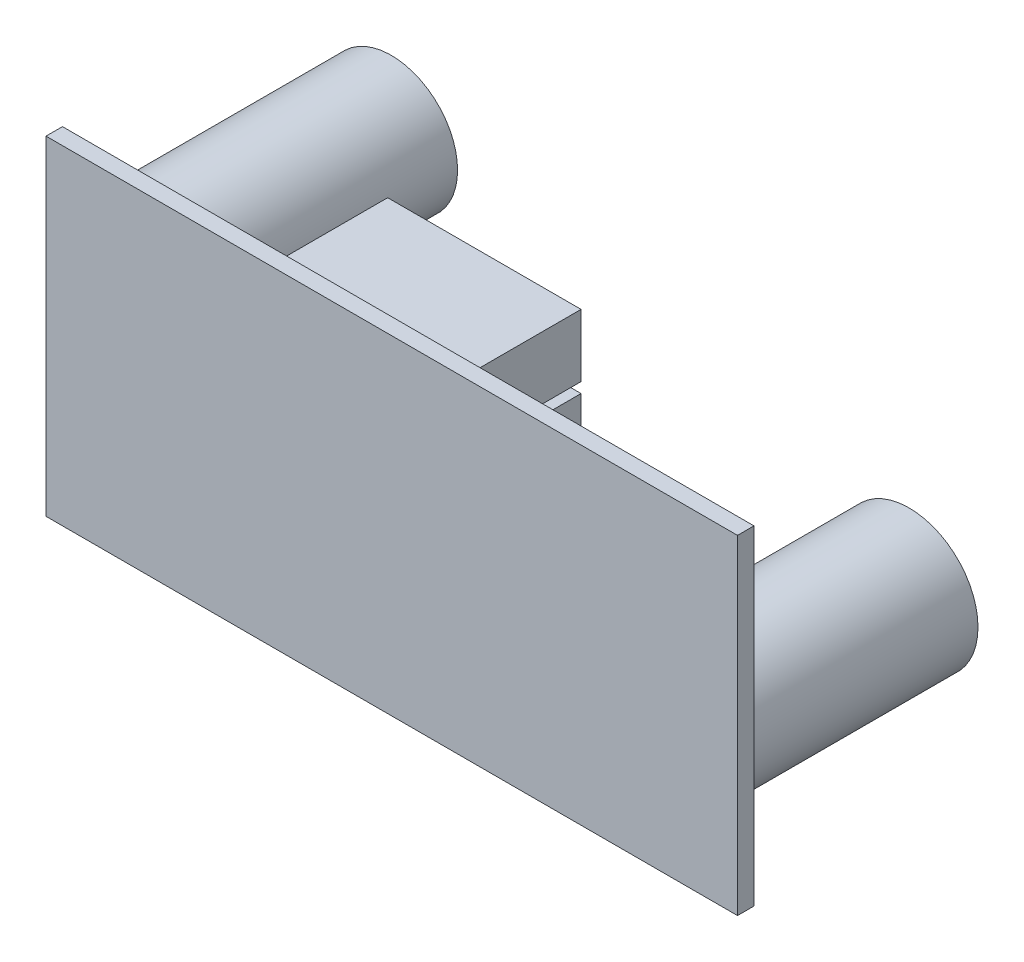
ISO-10303-21;
HEADER;
FILE_DESCRIPTION(('STEP AP214'),'2;1');
FILE_NAME('part.step','',(''),(''),'','','');
FILE_SCHEMA(('AUTOMOTIVE_DESIGN { 1 0 10303 214 1 1 1 1 }'));
ENDSEC;
DATA;
#1=APPLICATION_CONTEXT('core data for automotive mechanical design processes');
#2=APPLICATION_PROTOCOL_DEFINITION('international standard','automotive_design',2000,#1);
#3=PRODUCT_CONTEXT('',#1,'mechanical');
#4=PRODUCT('Part','Part','',(#3));
#5=PRODUCT_RELATED_PRODUCT_CATEGORY('part','',(#4));
#6=PRODUCT_DEFINITION_FORMATION('','',#4);
#7=PRODUCT_DEFINITION_CONTEXT('part definition',#1,'design');
#8=PRODUCT_DEFINITION('design','',#6,#7);
#9=PRODUCT_DEFINITION_SHAPE('','',#8);
#10=(LENGTH_UNIT() NAMED_UNIT(*) SI_UNIT(.MILLI.,.METRE.));
#11=(NAMED_UNIT(*) PLANE_ANGLE_UNIT() SI_UNIT($,.RADIAN.));
#12=(NAMED_UNIT(*) SI_UNIT($,.STERADIAN.) SOLID_ANGLE_UNIT());
#13=UNCERTAINTY_MEASURE_WITH_UNIT(LENGTH_MEASURE(1.E-05),#10,'distance_accuracy_value','');
#14=(GEOMETRIC_REPRESENTATION_CONTEXT(3) GLOBAL_UNCERTAINTY_ASSIGNED_CONTEXT((#13)) GLOBAL_UNIT_ASSIGNED_CONTEXT((#10,
#11,#12)) REPRESENTATION_CONTEXT('',''));
#15=CARTESIAN_POINT('',(0.,0.,0.));
#16=DIRECTION('',(0.,0.,1.));
#17=DIRECTION('',(1.,0.,0.));
#18=AXIS2_PLACEMENT_3D('',#15,#16,#17);
#19=CARTESIAN_POINT('',(-25.9311740890688,5.2914979757085,1.));
#20=DIRECTION('',(1.,0.,0.));
#21=DIRECTION('',(0.,1.,0.));
#22=AXIS2_PLACEMENT_3D('',#19,#20,#21);
#23=PLANE('',#22);
#24=DIRECTION('',(0.,-1.,0.));
#25=VECTOR('',#24,1.);
#26=CARTESIAN_POINT('',(-25.9311740890688,5.2914979757085,0.));
#27=LINE('',#26,#25);
#28=CARTESIAN_POINT('',(-25.9311740890688,5.2914979757085,0.));
#29=VERTEX_POINT('',#28);
#30=CARTESIAN_POINT('',(-25.9311740890688,-14.7085020242915,0.));
#31=VERTEX_POINT('',#30);
#32=EDGE_CURVE('E202',#29,#31,#27,.T.);
#33=ORIENTED_EDGE('',*,*,#32,.T.);
#34=DIRECTION('',(0.,0.,-1.));
#35=VECTOR('',#34,1.);
#36=CARTESIAN_POINT('',(-25.9311740890688,-14.7085020242915,1.));
#37=LINE('',#36,#35);
#38=CARTESIAN_POINT('',(-25.9311740890688,-14.7085020242915,1.));
#39=VERTEX_POINT('',#38);
#40=EDGE_CURVE('E11',#39,#31,#37,.T.);
#41=ORIENTED_EDGE('',*,*,#40,.F.);
#42=DIRECTION('',(0.,-1.,0.));
#43=VECTOR('',#42,1.);
#44=CARTESIAN_POINT('',(-25.9311740890688,5.2914979757085,1.));
#45=LINE('',#44,#43);
#46=CARTESIAN_POINT('',(-25.9311740890688,5.2914979757085,1.));
#47=VERTEX_POINT('',#46);
#48=EDGE_CURVE('E205',#47,#39,#45,.T.);
#49=ORIENTED_EDGE('',*,*,#48,.F.);
#50=DIRECTION('',(0.,0.,-1.));
#51=VECTOR('',#50,1.);
#52=CARTESIAN_POINT('',(-25.9311740890688,5.2914979757085,1.));
#53=LINE('',#52,#51);
#54=EDGE_CURVE('E215',#47,#29,#53,.T.);
#55=ORIENTED_EDGE('',*,*,#54,.T.);
#56=EDGE_LOOP('',(#33,#41,#49,#55));
#57=FACE_BOUND('',#56,.T.);
#58=ADVANCED_FACE('F34',(#57),#23,.F.);
#59=CARTESIAN_POINT('',(-25.9311740890688,-14.7085020242915,1.));
#60=DIRECTION('',(0.,1.,0.));
#61=DIRECTION('',(0.,0.,1.));
#62=AXIS2_PLACEMENT_3D('',#59,#60,#61);
#63=PLANE('',#62);
#64=DIRECTION('',(1.,0.,0.));
#65=VECTOR('',#64,1.);
#66=CARTESIAN_POINT('',(-25.9311740890688,-14.7085020242915,0.));
#67=LINE('',#66,#65);
#68=CARTESIAN_POINT('',(16.0688259109312,-14.7085020242915,0.));
#69=VERTEX_POINT('',#68);
#70=EDGE_CURVE('E218',#31,#69,#67,.T.);
#71=ORIENTED_EDGE('',*,*,#70,.T.);
#72=DIRECTION('',(0.,0.,-1.));
#73=VECTOR('',#72,1.);
#74=CARTESIAN_POINT('',(16.0688259109312,-14.7085020242915,1.));
#75=LINE('',#74,#73);
#76=CARTESIAN_POINT('',(16.0688259109312,-14.7085020242915,1.));
#77=VERTEX_POINT('',#76);
#78=EDGE_CURVE('E41',#77,#69,#75,.T.);
#79=ORIENTED_EDGE('',*,*,#78,.F.);
#80=DIRECTION('',(1.,0.,0.));
#81=VECTOR('',#80,1.);
#82=CARTESIAN_POINT('',(-25.9311740890688,-14.7085020242915,1.));
#83=LINE('',#82,#81);
#84=EDGE_CURVE('E208',#39,#77,#83,.T.);
#85=ORIENTED_EDGE('',*,*,#84,.F.);
#86=ORIENTED_EDGE('',*,*,#40,.T.);
#87=EDGE_LOOP('',(#71,#79,#85,#86));
#88=FACE_BOUND('',#87,.T.);
#89=ADVANCED_FACE('F248',(#88),#63,.F.);
#90=CARTESIAN_POINT('',(16.0688259109312,5.2914979757085,1.));
#91=DIRECTION('',(-1.,0.,0.));
#92=DIRECTION('',(0.,0.,1.));
#93=AXIS2_PLACEMENT_3D('',#90,#91,#92);
#94=PLANE('',#93);
#95=DIRECTION('',(0.,1.,0.));
#96=VECTOR('',#95,1.);
#97=CARTESIAN_POINT('',(16.0688259109312,5.2914979757085,0.));
#98=LINE('',#97,#96);
#99=CARTESIAN_POINT('',(16.0688259109312,5.2914979757085,0.));
#100=VERTEX_POINT('',#99);
#101=EDGE_CURVE('E220',#69,#100,#98,.T.);
#102=ORIENTED_EDGE('',*,*,#101,.T.);
#103=DIRECTION('',(0.,0.,-1.));
#104=VECTOR('',#103,1.);
#105=CARTESIAN_POINT('',(16.0688259109312,5.2914979757085,1.));
#106=LINE('',#105,#104);
#107=CARTESIAN_POINT('',(16.0688259109312,5.2914979757085,1.));
#108=VERTEX_POINT('',#107);
#109=EDGE_CURVE('E225',#108,#100,#106,.T.);
#110=ORIENTED_EDGE('',*,*,#109,.F.);
#111=DIRECTION('',(0.,1.,0.));
#112=VECTOR('',#111,1.);
#113=CARTESIAN_POINT('',(16.0688259109312,5.2914979757085,1.));
#114=LINE('',#113,#112);
#115=EDGE_CURVE('E211',#77,#108,#114,.T.);
#116=ORIENTED_EDGE('',*,*,#115,.F.);
#117=ORIENTED_EDGE('',*,*,#78,.T.);
#118=EDGE_LOOP('',(#102,#110,#116,#117));
#119=FACE_BOUND('',#118,.T.);
#120=ADVANCED_FACE('F232',(#119),#94,.F.);
#121=CARTESIAN_POINT('',(-25.9311740890688,5.2914979757085,1.));
#122=DIRECTION('',(0.,-1.,0.));
#123=DIRECTION('',(0.,0.,-1.));
#124=AXIS2_PLACEMENT_3D('',#121,#122,#123);
#125=PLANE('',#124);
#126=DIRECTION('',(-1.,0.,0.));
#127=VECTOR('',#126,1.);
#128=CARTESIAN_POINT('',(-25.9311740890688,5.2914979757085,0.));
#129=LINE('',#128,#127);
#130=EDGE_CURVE('E209',#100,#29,#129,.T.);
#131=ORIENTED_EDGE('',*,*,#130,.T.);
#132=ORIENTED_EDGE('',*,*,#54,.F.);
#133=DIRECTION('',(-1.,0.,0.));
#134=VECTOR('',#133,1.);
#135=CARTESIAN_POINT('',(-25.9311740890688,5.2914979757085,1.));
#136=LINE('',#135,#134);
#137=EDGE_CURVE('E213',#108,#47,#136,.T.);
#138=ORIENTED_EDGE('',*,*,#137,.F.);
#139=ORIENTED_EDGE('',*,*,#109,.T.);
#140=EDGE_LOOP('',(#131,#132,#138,#139));
#141=FACE_BOUND('',#140,.T.);
#142=ADVANCED_FACE('F241',(#141),#125,.F.);
#143=CARTESIAN_POINT('',(0.,0.,1.));
#144=DIRECTION('',(0.,0.,1.));
#145=DIRECTION('',(1.,0.,0.));
#146=AXIS2_PLACEMENT_3D('',#143,#144,#145);
#147=PLANE('',#146);
#148=ORIENTED_EDGE('',*,*,#48,.T.);
#149=ORIENTED_EDGE('',*,*,#84,.T.);
#150=ORIENTED_EDGE('',*,*,#115,.T.);
#151=ORIENTED_EDGE('',*,*,#137,.T.);
#152=EDGE_LOOP('',(#148,#149,#150,#151));
#153=FACE_BOUND('',#152,.T.);
#154=ADVANCED_FACE('F247',(#153),#147,.T.);
#155=CARTESIAN_POINT('',(0.,0.,0.));
#156=DIRECTION('',(0.,0.,1.));
#157=DIRECTION('',(1.,0.,0.));
#158=AXIS2_PLACEMENT_3D('',#155,#156,#157);
#159=PLANE('',#158);
#160=DIRECTION('',(-1.,0.,0.));
#161=VECTOR('',#160,1.);
#162=CARTESIAN_POINT('',(-13.1781841422702,0.,0.));
#163=LINE('',#162,#161);
#164=CARTESIAN_POINT('',(-1.43471503719272,0.,0.));
#165=VERTEX_POINT('',#164);
#166=CARTESIAN_POINT('',(-13.1781841422702,0.,0.));
#167=VERTEX_POINT('',#166);
#168=EDGE_CURVE('E147',#165,#167,#163,.T.);
#169=ORIENTED_EDGE('',*,*,#168,.T.);
#170=DIRECTION('',(0.,-1.,0.));
#171=VECTOR('',#170,1.);
#172=CARTESIAN_POINT('',(-13.1781841422702,0.,0.));
#173=LINE('',#172,#171);
#174=CARTESIAN_POINT('',(-13.1781841422702,-12.9835587703897,0.));
#175=VERTEX_POINT('',#174);
#176=EDGE_CURVE('E154',#167,#175,#173,.T.);
#177=ORIENTED_EDGE('',*,*,#176,.T.);
#178=DIRECTION('',(1.,0.,0.));
#179=VECTOR('',#178,1.);
#180=CARTESIAN_POINT('',(-13.1781841422702,-12.9835587703897,0.));
#181=LINE('',#180,#179);
#182=CARTESIAN_POINT('',(-1.43471503719272,-12.9835587703897,0.));
#183=VERTEX_POINT('',#182);
#184=EDGE_CURVE('E127',#175,#183,#181,.T.);
#185=ORIENTED_EDGE('',*,*,#184,.T.);
#186=DIRECTION('',(0.,1.,0.));
#187=VECTOR('',#186,1.);
#188=CARTESIAN_POINT('',(-1.43471503719272,0.,0.));
#189=LINE('',#188,#187);
#190=EDGE_CURVE('E48',#183,#165,#189,.T.);
#191=ORIENTED_EDGE('',*,*,#190,.T.);
#192=EDGE_LOOP('',(#169,#177,#185,#191));
#193=FACE_BOUND('',#192,.T.);
#194=DIRECTION('',(-1.,0.,0.));
#195=VECTOR('',#194,1.);
#196=CARTESIAN_POINT('',(-13.1781841422702,4.42810080411027,0.));
#197=LINE('',#196,#195);
#198=CARTESIAN_POINT('',(-1.43309074962872,4.42810080411027,0.));
#199=VERTEX_POINT('',#198);
#200=CARTESIAN_POINT('',(-13.1781841422702,4.42810080411027,0.));
#201=VERTEX_POINT('',#200);
#202=EDGE_CURVE('E167',#199,#201,#197,.T.);
#203=ORIENTED_EDGE('',*,*,#202,.T.);
#204=DIRECTION('',(0.,-1.,0.));
#205=VECTOR('',#204,1.);
#206=CARTESIAN_POINT('',(-13.1781841422702,4.42810080411027,0.));
#207=LINE('',#206,#205);
#208=CARTESIAN_POINT('',(-13.1781841422702,0.627354008456926,0.));
#209=VERTEX_POINT('',#208);
#210=EDGE_CURVE('E159',#201,#209,#207,.T.);
#211=ORIENTED_EDGE('',*,*,#210,.T.);
#212=DIRECTION('',(1.,0.,0.));
#213=VECTOR('',#212,1.);
#214=CARTESIAN_POINT('',(-13.1781841422702,0.627354008456926,0.));
#215=LINE('',#214,#213);
#216=CARTESIAN_POINT('',(-1.43309074962872,0.627354008456926,0.));
#217=VERTEX_POINT('',#216);
#218=EDGE_CURVE('E179',#209,#217,#215,.T.);
#219=ORIENTED_EDGE('',*,*,#218,.T.);
#220=DIRECTION('',(0.,1.,0.));
#221=VECTOR('',#220,1.);
#222=CARTESIAN_POINT('',(-1.43309074962872,4.42810080411027,0.));
#223=LINE('',#222,#221);
#224=EDGE_CURVE('E56',#217,#199,#223,.T.);
#225=ORIENTED_EDGE('',*,*,#224,.T.);
#226=EDGE_LOOP('',(#203,#211,#219,#225));
#227=FACE_BOUND('',#226,.T.);
#228=CARTESIAN_POINT('',(10.4930760803745,-8.23466300271962,0.));
#229=DIRECTION('',(0.,0.,1.));
#230=DIRECTION('',(1.,0.,0.));
#231=AXIS2_PLACEMENT_3D('',#228,#229,#230);
#232=CIRCLE('',#231,4.18270672569634);
#233=CARTESIAN_POINT('',(14.6757828060708,-8.23466300271962,0.));
#234=VERTEX_POINT('',#233);
#235=EDGE_CURVE('E187',#234,#234,#232,.T.);
#236=ORIENTED_EDGE('',*,*,#235,.T.);
#237=EDGE_LOOP('',(#236));
#238=FACE_BOUND('',#237,.T.);
#239=CARTESIAN_POINT('',(-20.9611451627819,0.,0.));
#240=DIRECTION('',(0.,0.,1.));
#241=DIRECTION('',(1.,0.,0.));
#242=AXIS2_PLACEMENT_3D('',#239,#240,#241);
#243=CIRCLE('',#242,4.02793859117068);
#244=CARTESIAN_POINT('',(-16.9332065716112,0.,0.));
#245=VERTEX_POINT('',#244);
#246=EDGE_CURVE('E196',#245,#245,#243,.T.);
#247=ORIENTED_EDGE('',*,*,#246,.T.);
#248=EDGE_LOOP('',(#247));
#249=FACE_BOUND('',#248,.T.);
#250=ORIENTED_EDGE('',*,*,#32,.F.);
#251=ORIENTED_EDGE('',*,*,#130,.F.);
#252=ORIENTED_EDGE('',*,*,#101,.F.);
#253=ORIENTED_EDGE('',*,*,#70,.F.);
#254=EDGE_LOOP('',(#250,#251,#252,#253));
#255=FACE_BOUND('',#254,.T.);
#256=ADVANCED_FACE('F238',(#193,#227,#238,#249,#255),#159,.F.);
#257=CARTESIAN_POINT('',(-20.9611451627819,0.,-15.));
#258=DIRECTION('',(0.,0.,1.));
#259=DIRECTION('',(1.,0.,0.));
#260=AXIS2_PLACEMENT_3D('',#257,#258,#259);
#261=CYLINDRICAL_SURFACE('',#260,4.02793859117068);
#262=CARTESIAN_POINT('',(-20.9611451627819,0.,-15.));
#263=DIRECTION('',(0.,0.,1.));
#264=DIRECTION('',(1.,0.,0.));
#265=AXIS2_PLACEMENT_3D('',#262,#263,#264);
#266=CIRCLE('',#265,4.02793859117068);
#267=CARTESIAN_POINT('',(-16.9332065716112,0.,-15.));
#268=VERTEX_POINT('',#267);
#269=EDGE_CURVE('E199',#268,#268,#266,.T.);
#270=ORIENTED_EDGE('',*,*,#269,.T.);
#271=EDGE_LOOP('',(#270));
#272=FACE_BOUND('',#271,.T.);
#273=ORIENTED_EDGE('',*,*,#246,.F.);
#274=EDGE_LOOP('',(#273));
#275=FACE_BOUND('',#274,.T.);
#276=ADVANCED_FACE('F260',(#272,#275),#261,.T.);
#277=CARTESIAN_POINT('',(-20.9611451627819,0.,-15.));
#278=DIRECTION('',(0.,0.,1.));
#279=DIRECTION('',(1.,0.,0.));
#280=AXIS2_PLACEMENT_3D('',#277,#278,#279);
#281=PLANE('',#280);
#282=ORIENTED_EDGE('',*,*,#269,.F.);
#283=EDGE_LOOP('',(#282));
#284=FACE_BOUND('',#283,.T.);
#285=ADVANCED_FACE('F266',(#284),#281,.F.);
#286=CARTESIAN_POINT('',(10.4930760803745,-8.23466300271962,-15.));
#287=DIRECTION('',(0.,0.,1.));
#288=DIRECTION('',(1.,0.,0.));
#289=AXIS2_PLACEMENT_3D('',#286,#287,#288);
#290=CYLINDRICAL_SURFACE('',#289,4.18270672569634);
#291=CARTESIAN_POINT('',(10.4930760803745,-8.23466300271962,-15.));
#292=DIRECTION('',(0.,0.,1.));
#293=DIRECTION('',(1.,0.,0.));
#294=AXIS2_PLACEMENT_3D('',#291,#292,#293);
#295=CIRCLE('',#294,4.18270672569634);
#296=CARTESIAN_POINT('',(14.6757828060708,-8.23466300271962,-15.));
#297=VERTEX_POINT('',#296);
#298=EDGE_CURVE('E193',#297,#297,#295,.T.);
#299=ORIENTED_EDGE('',*,*,#298,.T.);
#300=EDGE_LOOP('',(#299));
#301=FACE_BOUND('',#300,.T.);
#302=ORIENTED_EDGE('',*,*,#235,.F.);
#303=EDGE_LOOP('',(#302));
#304=FACE_BOUND('',#303,.T.);
#305=ADVANCED_FACE('F270',(#301,#304),#290,.T.);
#306=CARTESIAN_POINT('',(10.4930760803745,-8.23466300271962,-15.));
#307=DIRECTION('',(0.,0.,1.));
#308=DIRECTION('',(1.,0.,0.));
#309=AXIS2_PLACEMENT_3D('',#306,#307,#308);
#310=PLANE('',#309);
#311=ORIENTED_EDGE('',*,*,#298,.F.);
#312=EDGE_LOOP('',(#311));
#313=FACE_BOUND('',#312,.T.);
#314=ADVANCED_FACE('F274',(#313),#310,.F.);
#315=CARTESIAN_POINT('',(-13.1781841422702,4.42810080411027,-6.99999999999999));
#316=DIRECTION('',(-1.,0.,0.));
#317=DIRECTION('',(0.,0.,1.));
#318=AXIS2_PLACEMENT_3D('',#315,#316,#317);
#319=PLANE('',#318);
#320=ORIENTED_EDGE('',*,*,#210,.F.);
#321=DIRECTION('',(0.,0.,1.));
#322=VECTOR('',#321,1.);
#323=CARTESIAN_POINT('',(-13.1781841422702,4.42810080411027,-6.99999999999999));
#324=LINE('',#323,#322);
#325=CARTESIAN_POINT('',(-13.1781841422702,4.42810080411027,-6.99999999999999));
#326=VERTEX_POINT('',#325);
#327=EDGE_CURVE('E185',#326,#201,#324,.T.);
#328=ORIENTED_EDGE('',*,*,#327,.F.);
#329=DIRECTION('',(0.,-1.,0.));
#330=VECTOR('',#329,1.);
#331=CARTESIAN_POINT('',(-13.1781841422702,4.42810080411027,-6.99999999999999));
#332=LINE('',#331,#330);
#333=CARTESIAN_POINT('',(-13.1781841422702,0.627354008456926,-6.99999999999999));
#334=VERTEX_POINT('',#333);
#335=EDGE_CURVE('E163',#326,#334,#332,.T.);
#336=ORIENTED_EDGE('',*,*,#335,.T.);
#337=DIRECTION('',(0.,0.,1.));
#338=VECTOR('',#337,1.);
#339=CARTESIAN_POINT('',(-13.1781841422702,0.627354008456926,-6.99999999999999));
#340=LINE('',#339,#338);
#341=EDGE_CURVE('E176',#334,#209,#340,.T.);
#342=ORIENTED_EDGE('',*,*,#341,.T.);
#343=EDGE_LOOP('',(#320,#328,#336,#342));
#344=FACE_BOUND('',#343,.T.);
#345=ADVANCED_FACE('F278',(#344),#319,.T.);
#346=CARTESIAN_POINT('',(-13.1781841422702,4.42810080411027,-6.99999999999999));
#347=DIRECTION('',(0.,1.,0.));
#348=DIRECTION('',(0.,0.,1.));
#349=AXIS2_PLACEMENT_3D('',#346,#347,#348);
#350=PLANE('',#349);
#351=ORIENTED_EDGE('',*,*,#202,.F.);
#352=DIRECTION('',(0.,0.,1.));
#353=VECTOR('',#352,1.);
#354=CARTESIAN_POINT('',(-1.43309074962872,4.42810080411027,-6.99999999999999));
#355=LINE('',#354,#353);
#356=CARTESIAN_POINT('',(-1.43309074962872,4.42810080411027,-6.99999999999999));
#357=VERTEX_POINT('',#356);
#358=EDGE_CURVE('E188',#357,#199,#355,.T.);
#359=ORIENTED_EDGE('',*,*,#358,.F.);
#360=DIRECTION('',(-1.,0.,0.));
#361=VECTOR('',#360,1.);
#362=CARTESIAN_POINT('',(-13.1781841422702,4.42810080411027,-6.99999999999999));
#363=LINE('',#362,#361);
#364=EDGE_CURVE('E173',#357,#326,#363,.T.);
#365=ORIENTED_EDGE('',*,*,#364,.T.);
#366=ORIENTED_EDGE('',*,*,#327,.T.);
#367=EDGE_LOOP('',(#351,#359,#365,#366));
#368=FACE_BOUND('',#367,.T.);
#369=ADVANCED_FACE('F282',(#368),#350,.T.);
#370=CARTESIAN_POINT('',(-1.43309074962872,4.42810080411027,-6.99999999999999));
#371=DIRECTION('',(1.,0.,0.));
#372=DIRECTION('',(0.,0.,-1.));
#373=AXIS2_PLACEMENT_3D('',#370,#371,#372);
#374=PLANE('',#373);
#375=ORIENTED_EDGE('',*,*,#224,.F.);
#376=DIRECTION('',(0.,0.,1.));
#377=VECTOR('',#376,1.);
#378=CARTESIAN_POINT('',(-1.43309074962872,0.627354008456926,-6.99999999999999));
#379=LINE('',#378,#377);
#380=CARTESIAN_POINT('',(-1.43309074962872,0.627354008456926,-6.99999999999999));
#381=VERTEX_POINT('',#380);
#382=EDGE_CURVE('E190',#381,#217,#379,.T.);
#383=ORIENTED_EDGE('',*,*,#382,.F.);
#384=DIRECTION('',(0.,1.,0.));
#385=VECTOR('',#384,1.);
#386=CARTESIAN_POINT('',(-1.43309074962872,4.42810080411027,-6.99999999999999));
#387=LINE('',#386,#385);
#388=EDGE_CURVE('E170',#381,#357,#387,.T.);
#389=ORIENTED_EDGE('',*,*,#388,.T.);
#390=ORIENTED_EDGE('',*,*,#358,.T.);
#391=EDGE_LOOP('',(#375,#383,#389,#390));
#392=FACE_BOUND('',#391,.T.);
#393=ADVANCED_FACE('F288',(#392),#374,.T.);
#394=CARTESIAN_POINT('',(-13.1781841422702,0.627354008456926,-6.99999999999999));
#395=DIRECTION('',(0.,-1.,0.));
#396=DIRECTION('',(0.,0.,-1.));
#397=AXIS2_PLACEMENT_3D('',#394,#395,#396);
#398=PLANE('',#397);
#399=ORIENTED_EDGE('',*,*,#218,.F.);
#400=ORIENTED_EDGE('',*,*,#341,.F.);
#401=DIRECTION('',(1.,0.,0.));
#402=VECTOR('',#401,1.);
#403=CARTESIAN_POINT('',(-13.1781841422702,0.627354008456926,-6.99999999999999));
#404=LINE('',#403,#402);
#405=EDGE_CURVE('E166',#334,#381,#404,.T.);
#406=ORIENTED_EDGE('',*,*,#405,.T.);
#407=ORIENTED_EDGE('',*,*,#382,.T.);
#408=EDGE_LOOP('',(#399,#400,#406,#407));
#409=FACE_BOUND('',#408,.T.);
#410=ADVANCED_FACE('F284',(#409),#398,.T.);
#411=CARTESIAN_POINT('',(0.,0.,-6.99999999999999));
#412=DIRECTION('',(0.,0.,1.));
#413=DIRECTION('',(1.,0.,0.));
#414=AXIS2_PLACEMENT_3D('',#411,#412,#413);
#415=PLANE('',#414);
#416=ORIENTED_EDGE('',*,*,#335,.F.);
#417=ORIENTED_EDGE('',*,*,#364,.F.);
#418=ORIENTED_EDGE('',*,*,#388,.F.);
#419=ORIENTED_EDGE('',*,*,#405,.F.);
#420=EDGE_LOOP('',(#416,#417,#418,#419));
#421=FACE_BOUND('',#420,.T.);
#422=ADVANCED_FACE('F287',(#421),#415,.F.);
#423=CARTESIAN_POINT('',(-13.1781841422702,0.,-6.99999999999999));
#424=DIRECTION('',(-1.,0.,0.));
#425=DIRECTION('',(0.,0.,1.));
#426=AXIS2_PLACEMENT_3D('',#423,#424,#425);
#427=PLANE('',#426);
#428=ORIENTED_EDGE('',*,*,#176,.F.);
#429=DIRECTION('',(0.,0.,1.));
#430=VECTOR('',#429,1.);
#431=CARTESIAN_POINT('',(-13.1781841422702,0.,-6.99999999999999));
#432=LINE('',#431,#430);
#433=CARTESIAN_POINT('',(-13.1781841422702,0.,-6.99999999999999));
#434=VERTEX_POINT('',#433);
#435=EDGE_CURVE('E146',#434,#167,#432,.T.);
#436=ORIENTED_EDGE('',*,*,#435,.F.);
#437=DIRECTION('',(0.,-1.,0.));
#438=VECTOR('',#437,1.);
#439=CARTESIAN_POINT('',(-13.1781841422702,0.,-6.99999999999999));
#440=LINE('',#439,#438);
#441=CARTESIAN_POINT('',(-13.1781841422702,-12.9835587703897,-6.99999999999999));
#442=VERTEX_POINT('',#441);
#443=EDGE_CURVE('E140',#434,#442,#440,.T.);
#444=ORIENTED_EDGE('',*,*,#443,.T.);
#445=DIRECTION('',(0.,0.,1.));
#446=VECTOR('',#445,1.);
#447=CARTESIAN_POINT('',(-13.1781841422702,-12.9835587703897,-6.99999999999999));
#448=LINE('',#447,#446);
#449=EDGE_CURVE('E122',#442,#175,#448,.T.);
#450=ORIENTED_EDGE('',*,*,#449,.T.);
#451=EDGE_LOOP('',(#428,#436,#444,#450));
#452=FACE_BOUND('',#451,.T.);
#453=ADVANCED_FACE('F145',(#452),#427,.T.);
#454=CARTESIAN_POINT('',(-13.1781841422702,0.,-6.99999999999999));
#455=DIRECTION('',(0.,1.,0.));
#456=DIRECTION('',(0.,0.,1.));
#457=AXIS2_PLACEMENT_3D('',#454,#455,#456);
#458=PLANE('',#457);
#459=ORIENTED_EDGE('',*,*,#168,.F.);
#460=DIRECTION('',(0.,0.,1.));
#461=VECTOR('',#460,1.);
#462=CARTESIAN_POINT('',(-1.43471503719272,0.,-6.99999999999999));
#463=LINE('',#462,#461);
#464=CARTESIAN_POINT('',(-1.43471503719272,0.,-6.99999999999999));
#465=VERTEX_POINT('',#464);
#466=EDGE_CURVE('E160',#465,#165,#463,.T.);
#467=ORIENTED_EDGE('',*,*,#466,.F.);
#468=DIRECTION('',(-1.,0.,0.));
#469=VECTOR('',#468,1.);
#470=CARTESIAN_POINT('',(-13.1781841422702,0.,-6.99999999999999));
#471=LINE('',#470,#469);
#472=EDGE_CURVE('E133',#465,#434,#471,.T.);
#473=ORIENTED_EDGE('',*,*,#472,.T.);
#474=ORIENTED_EDGE('',*,*,#435,.T.);
#475=EDGE_LOOP('',(#459,#467,#473,#474));
#476=FACE_BOUND('',#475,.T.);
#477=ADVANCED_FACE('F300',(#476),#458,.T.);
#478=CARTESIAN_POINT('',(-1.43471503719272,0.,-6.99999999999999));
#479=DIRECTION('',(1.,0.,0.));
#480=DIRECTION('',(0.,0.,-1.));
#481=AXIS2_PLACEMENT_3D('',#478,#479,#480);
#482=PLANE('',#481);
#483=ORIENTED_EDGE('',*,*,#190,.F.);
#484=DIRECTION('',(0.,0.,1.));
#485=VECTOR('',#484,1.);
#486=CARTESIAN_POINT('',(-1.43471503719272,-12.9835587703897,-6.99999999999999));
#487=LINE('',#486,#485);
#488=CARTESIAN_POINT('',(-1.43471503719272,-12.9835587703897,-6.99999999999999));
#489=VERTEX_POINT('',#488);
#490=EDGE_CURVE('E132',#489,#183,#487,.T.);
#491=ORIENTED_EDGE('',*,*,#490,.F.);
#492=DIRECTION('',(0.,1.,0.));
#493=VECTOR('',#492,1.);
#494=CARTESIAN_POINT('',(-1.43471503719272,0.,-6.99999999999999));
#495=LINE('',#494,#493);
#496=EDGE_CURVE('E143',#489,#465,#495,.T.);
#497=ORIENTED_EDGE('',*,*,#496,.T.);
#498=ORIENTED_EDGE('',*,*,#466,.T.);
#499=EDGE_LOOP('',(#483,#491,#497,#498));
#500=FACE_BOUND('',#499,.T.);
#501=ADVANCED_FACE('F303',(#500),#482,.T.);
#502=CARTESIAN_POINT('',(-13.1781841422702,-12.9835587703897,-6.99999999999999));
#503=DIRECTION('',(0.,-1.,0.));
#504=DIRECTION('',(0.,0.,-1.));
#505=AXIS2_PLACEMENT_3D('',#502,#503,#504);
#506=PLANE('',#505);
#507=ORIENTED_EDGE('',*,*,#184,.F.);
#508=ORIENTED_EDGE('',*,*,#449,.F.);
#509=DIRECTION('',(1.,0.,0.));
#510=VECTOR('',#509,1.);
#511=CARTESIAN_POINT('',(-13.1781841422702,-12.9835587703897,-6.99999999999999));
#512=LINE('',#511,#510);
#513=EDGE_CURVE('E125',#442,#489,#512,.T.);
#514=ORIENTED_EDGE('',*,*,#513,.T.);
#515=ORIENTED_EDGE('',*,*,#490,.T.);
#516=EDGE_LOOP('',(#507,#508,#514,#515));
#517=FACE_BOUND('',#516,.T.);
#518=ADVANCED_FACE('F124',(#517),#506,.T.);
#519=CARTESIAN_POINT('',(0.,0.,-6.99999999999999));
#520=DIRECTION('',(0.,0.,1.));
#521=DIRECTION('',(1.,0.,0.));
#522=AXIS2_PLACEMENT_3D('',#519,#520,#521);
#523=PLANE('',#522);
#524=ORIENTED_EDGE('',*,*,#443,.F.);
#525=ORIENTED_EDGE('',*,*,#472,.F.);
#526=ORIENTED_EDGE('',*,*,#496,.F.);
#527=ORIENTED_EDGE('',*,*,#513,.F.);
#528=EDGE_LOOP('',(#524,#525,#526,#527));
#529=FACE_BOUND('',#528,.T.);
#530=ADVANCED_FACE('F138',(#529),#523,.F.);
#531=CLOSED_SHELL('',(#58,#89,#120,#142,#154,#256,#276,#285,#305,#314,#345,#369,#393,#410,#422,
#453,#477,#501,#518,#530));
#532=MANIFOLD_SOLID_BREP('B2',#531);
#533=ADVANCED_BREP_SHAPE_REPRESENTATION('',(#18,#532),#14);
#534=SHAPE_DEFINITION_REPRESENTATION(#9,#533);
ENDSEC;
END-ISO-10303-21;
